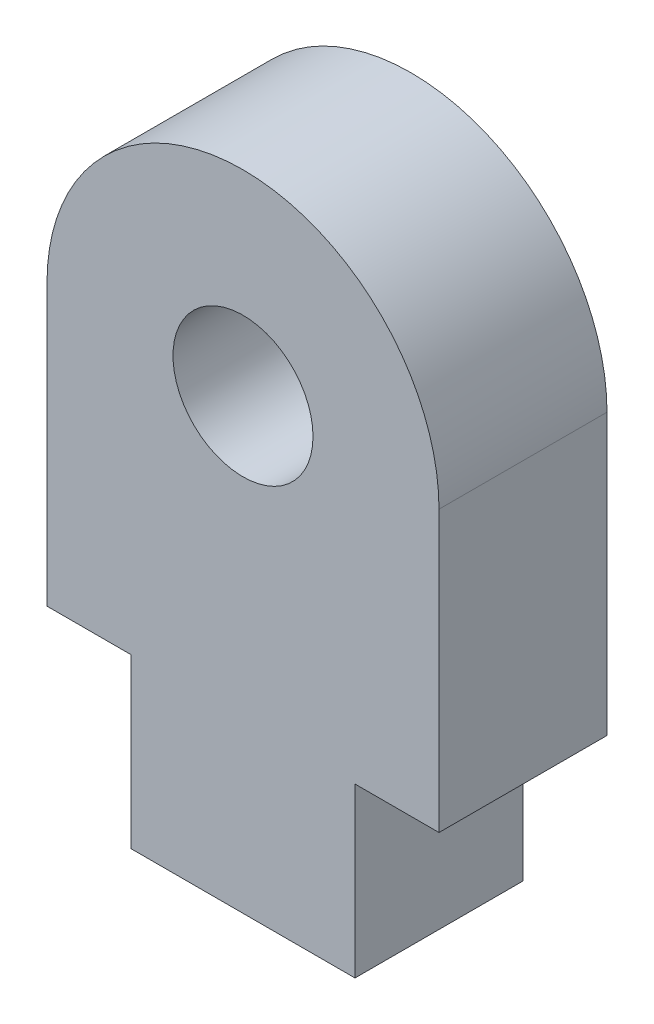
ISO-10303-21;
HEADER;
FILE_DESCRIPTION(('STEP AP214'),'2;1');
FILE_NAME('part.step','',(''),(''),'','','');
FILE_SCHEMA(('AUTOMOTIVE_DESIGN { 1 0 10303 214 1 1 1 1 }'));
ENDSEC;
DATA;
#1=APPLICATION_CONTEXT('core data for automotive mechanical design processes');
#2=APPLICATION_PROTOCOL_DEFINITION('international standard','automotive_design',2000,#1);
#3=PRODUCT_CONTEXT('',#1,'mechanical');
#4=PRODUCT('Part','Part','',(#3));
#5=PRODUCT_RELATED_PRODUCT_CATEGORY('part','',(#4));
#6=PRODUCT_DEFINITION_FORMATION('','',#4);
#7=PRODUCT_DEFINITION_CONTEXT('part definition',#1,'design');
#8=PRODUCT_DEFINITION('design','',#6,#7);
#9=PRODUCT_DEFINITION_SHAPE('','',#8);
#10=(LENGTH_UNIT() NAMED_UNIT(*) SI_UNIT(.MILLI.,.METRE.));
#11=(NAMED_UNIT(*) PLANE_ANGLE_UNIT() SI_UNIT($,.RADIAN.));
#12=(NAMED_UNIT(*) SI_UNIT($,.STERADIAN.) SOLID_ANGLE_UNIT());
#13=UNCERTAINTY_MEASURE_WITH_UNIT(LENGTH_MEASURE(1.E-05),#10,'distance_accuracy_value','');
#14=(GEOMETRIC_REPRESENTATION_CONTEXT(3) GLOBAL_UNCERTAINTY_ASSIGNED_CONTEXT((#13)) GLOBAL_UNIT_ASSIGNED_CONTEXT((#10,
#11,#12)) REPRESENTATION_CONTEXT('',''));
#15=CARTESIAN_POINT('',(0.,0.,0.));
#16=DIRECTION('',(0.,0.,1.));
#17=DIRECTION('',(1.,0.,0.));
#18=AXIS2_PLACEMENT_3D('',#15,#16,#17);
#19=CARTESIAN_POINT('',(0.,0.,3.));
#20=DIRECTION('',(0.,0.,1.));
#21=DIRECTION('',(1.,0.,0.));
#22=AXIS2_PLACEMENT_3D('',#19,#20,#21);
#23=PLANE('',#22);
#24=CARTESIAN_POINT('',(0.,0.,3.));
#25=DIRECTION('',(0.,0.,1.));
#26=DIRECTION('',(1.,0.,0.));
#27=AXIS2_PLACEMENT_3D('',#24,#25,#26);
#28=CIRCLE('',#27,3.5);
#29=CARTESIAN_POINT('',(3.5,0.,3.));
#30=VERTEX_POINT('',#29);
#31=CARTESIAN_POINT('',(-3.5,0.,3.));
#32=VERTEX_POINT('',#31);
#33=EDGE_CURVE('E145',#30,#32,#28,.T.);
#34=ORIENTED_EDGE('',*,*,#33,.T.);
#35=DIRECTION('',(0.,-1.,0.));
#36=VECTOR('',#35,1.);
#37=CARTESIAN_POINT('',(-3.5,0.,3.));
#38=LINE('',#37,#36);
#39=CARTESIAN_POINT('',(-3.5,-5.,3.));
#40=VERTEX_POINT('',#39);
#41=EDGE_CURVE('E93',#32,#40,#38,.T.);
#42=ORIENTED_EDGE('',*,*,#41,.T.);
#43=DIRECTION('',(1.,0.,0.));
#44=VECTOR('',#43,1.);
#45=CARTESIAN_POINT('',(-3.5,-5.,3.));
#46=LINE('',#45,#44);
#47=CARTESIAN_POINT('',(-2.,-5.,3.));
#48=VERTEX_POINT('',#47);
#49=EDGE_CURVE('E160',#40,#48,#46,.T.);
#50=ORIENTED_EDGE('',*,*,#49,.T.);
#51=DIRECTION('',(0.,-1.,0.));
#52=VECTOR('',#51,1.);
#53=CARTESIAN_POINT('',(-2.,-5.,3.));
#54=LINE('',#53,#52);
#55=CARTESIAN_POINT('',(-2.,-8.,3.));
#56=VERTEX_POINT('',#55);
#57=EDGE_CURVE('E173',#48,#56,#54,.T.);
#58=ORIENTED_EDGE('',*,*,#57,.T.);
#59=DIRECTION('',(1.,0.,0.));
#60=VECTOR('',#59,1.);
#61=CARTESIAN_POINT('',(-2.,-8.,3.));
#62=LINE('',#61,#60);
#63=CARTESIAN_POINT('',(2.,-8.,3.));
#64=VERTEX_POINT('',#63);
#65=EDGE_CURVE('E112',#56,#64,#62,.T.);
#66=ORIENTED_EDGE('',*,*,#65,.T.);
#67=DIRECTION('',(0.,1.,0.));
#68=VECTOR('',#67,1.);
#69=CARTESIAN_POINT('',(2.,-8.,3.));
#70=LINE('',#69,#68);
#71=CARTESIAN_POINT('',(2.,-5.,3.));
#72=VERTEX_POINT('',#71);
#73=EDGE_CURVE('E106',#64,#72,#70,.T.);
#74=ORIENTED_EDGE('',*,*,#73,.T.);
#75=DIRECTION('',(1.,0.,0.));
#76=VECTOR('',#75,1.);
#77=CARTESIAN_POINT('',(2.,-5.,3.));
#78=LINE('',#77,#76);
#79=CARTESIAN_POINT('',(3.5,-5.,3.));
#80=VERTEX_POINT('',#79);
#81=EDGE_CURVE('E110',#72,#80,#78,.T.);
#82=ORIENTED_EDGE('',*,*,#81,.T.);
#83=DIRECTION('',(0.,1.,0.));
#84=VECTOR('',#83,1.);
#85=CARTESIAN_POINT('',(3.5,-5.,3.));
#86=LINE('',#85,#84);
#87=EDGE_CURVE('E50',#80,#30,#86,.T.);
#88=ORIENTED_EDGE('',*,*,#87,.T.);
#89=EDGE_LOOP('',(#34,#42,#50,#58,#66,#74,#82,#88));
#90=FACE_BOUND('',#89,.T.);
#91=CARTESIAN_POINT('',(0.,0.,3.));
#92=DIRECTION('',(0.,0.,1.));
#93=DIRECTION('',(1.,0.,0.));
#94=AXIS2_PLACEMENT_3D('',#91,#92,#93);
#95=CIRCLE('',#94,1.25);
#96=CARTESIAN_POINT('',(1.25,0.,3.));
#97=VERTEX_POINT('',#96);
#98=EDGE_CURVE('E134',#97,#97,#95,.T.);
#99=ORIENTED_EDGE('',*,*,#98,.F.);
#100=EDGE_LOOP('',(#99));
#101=FACE_BOUND('',#100,.T.);
#102=ADVANCED_FACE('F33',(#90,#101),#23,.T.);
#103=CARTESIAN_POINT('',(0.,0.,0.));
#104=DIRECTION('',(0.,0.,1.));
#105=DIRECTION('',(1.,0.,0.));
#106=AXIS2_PLACEMENT_3D('',#103,#104,#105);
#107=PLANE('',#106);
#108=CARTESIAN_POINT('',(0.,0.,0.));
#109=DIRECTION('',(0.,0.,1.));
#110=DIRECTION('',(1.,0.,0.));
#111=AXIS2_PLACEMENT_3D('',#108,#109,#110);
#112=CIRCLE('',#111,3.5);
#113=CARTESIAN_POINT('',(3.5,0.,0.));
#114=VERTEX_POINT('',#113);
#115=CARTESIAN_POINT('',(-3.5,0.,0.));
#116=VERTEX_POINT('',#115);
#117=EDGE_CURVE('E130',#114,#116,#112,.T.);
#118=ORIENTED_EDGE('',*,*,#117,.F.);
#119=DIRECTION('',(0.,1.,0.));
#120=VECTOR('',#119,1.);
#121=CARTESIAN_POINT('',(3.5,-5.,0.));
#122=LINE('',#121,#120);
#123=CARTESIAN_POINT('',(3.5,-5.,0.));
#124=VERTEX_POINT('',#123);
#125=EDGE_CURVE('E85',#124,#114,#122,.T.);
#126=ORIENTED_EDGE('',*,*,#125,.F.);
#127=DIRECTION('',(1.,0.,0.));
#128=VECTOR('',#127,1.);
#129=CARTESIAN_POINT('',(2.,-5.,0.));
#130=LINE('',#129,#128);
#131=CARTESIAN_POINT('',(2.,-5.,0.));
#132=VERTEX_POINT('',#131);
#133=EDGE_CURVE('E79',#132,#124,#130,.T.);
#134=ORIENTED_EDGE('',*,*,#133,.F.);
#135=DIRECTION('',(0.,1.,0.));
#136=VECTOR('',#135,1.);
#137=CARTESIAN_POINT('',(2.,-8.,0.));
#138=LINE('',#137,#136);
#139=CARTESIAN_POINT('',(2.,-8.,0.));
#140=VERTEX_POINT('',#139);
#141=EDGE_CURVE('E120',#140,#132,#138,.T.);
#142=ORIENTED_EDGE('',*,*,#141,.F.);
#143=DIRECTION('',(1.,0.,0.));
#144=VECTOR('',#143,1.);
#145=CARTESIAN_POINT('',(-2.,-8.,0.));
#146=LINE('',#145,#144);
#147=CARTESIAN_POINT('',(-2.,-8.,0.));
#148=VERTEX_POINT('',#147);
#149=EDGE_CURVE('E140',#148,#140,#146,.T.);
#150=ORIENTED_EDGE('',*,*,#149,.F.);
#151=DIRECTION('',(0.,-1.,0.));
#152=VECTOR('',#151,1.);
#153=CARTESIAN_POINT('',(-2.,-5.,0.));
#154=LINE('',#153,#152);
#155=CARTESIAN_POINT('',(-2.,-5.,0.));
#156=VERTEX_POINT('',#155);
#157=EDGE_CURVE('E138',#156,#148,#154,.T.);
#158=ORIENTED_EDGE('',*,*,#157,.F.);
#159=DIRECTION('',(1.,0.,0.));
#160=VECTOR('',#159,1.);
#161=CARTESIAN_POINT('',(-3.5,-5.,0.));
#162=LINE('',#161,#160);
#163=CARTESIAN_POINT('',(-3.5,-5.,0.));
#164=VERTEX_POINT('',#163);
#165=EDGE_CURVE('E136',#164,#156,#162,.T.);
#166=ORIENTED_EDGE('',*,*,#165,.F.);
#167=DIRECTION('',(0.,-1.,0.));
#168=VECTOR('',#167,1.);
#169=CARTESIAN_POINT('',(-3.5,0.,0.));
#170=LINE('',#169,#168);
#171=EDGE_CURVE('E133',#116,#164,#170,.T.);
#172=ORIENTED_EDGE('',*,*,#171,.F.);
#173=EDGE_LOOP('',(#118,#126,#134,#142,#150,#158,#166,#172));
#174=FACE_BOUND('',#173,.T.);
#175=CARTESIAN_POINT('',(0.,0.,0.));
#176=DIRECTION('',(0.,0.,1.));
#177=DIRECTION('',(1.,0.,0.));
#178=AXIS2_PLACEMENT_3D('',#175,#176,#177);
#179=CIRCLE('',#178,1.25);
#180=CARTESIAN_POINT('',(1.25,0.,0.));
#181=VERTEX_POINT('',#180);
#182=EDGE_CURVE('E179',#181,#181,#179,.T.);
#183=ORIENTED_EDGE('',*,*,#182,.T.);
#184=EDGE_LOOP('',(#183));
#185=FACE_BOUND('',#184,.T.);
#186=ADVANCED_FACE('F164',(#174,#185),#107,.F.);
#187=CARTESIAN_POINT('',(0.,0.,3.));
#188=DIRECTION('',(0.,0.,-1.));
#189=DIRECTION('',(-1.,0.,0.));
#190=AXIS2_PLACEMENT_3D('',#187,#188,#189);
#191=CYLINDRICAL_SURFACE('',#190,3.5);
#192=ORIENTED_EDGE('',*,*,#117,.T.);
#193=DIRECTION('',(0.,0.,-1.));
#194=VECTOR('',#193,1.);
#195=CARTESIAN_POINT('',(-3.5,0.,3.));
#196=LINE('',#195,#194);
#197=EDGE_CURVE('E11',#32,#116,#196,.T.);
#198=ORIENTED_EDGE('',*,*,#197,.F.);
#199=ORIENTED_EDGE('',*,*,#33,.F.);
#200=DIRECTION('',(0.,0.,-1.));
#201=VECTOR('',#200,1.);
#202=CARTESIAN_POINT('',(3.5,0.,3.));
#203=LINE('',#202,#201);
#204=EDGE_CURVE('E126',#30,#114,#203,.T.);
#205=ORIENTED_EDGE('',*,*,#204,.T.);
#206=EDGE_LOOP('',(#192,#198,#199,#205));
#207=FACE_BOUND('',#206,.T.);
#208=ADVANCED_FACE('F35',(#207),#191,.T.);
#209=CARTESIAN_POINT('',(-3.5,0.,3.));
#210=DIRECTION('',(1.,0.,0.));
#211=DIRECTION('',(0.,1.,0.));
#212=AXIS2_PLACEMENT_3D('',#209,#210,#211);
#213=PLANE('',#212);
#214=ORIENTED_EDGE('',*,*,#171,.T.);
#215=DIRECTION('',(0.,0.,-1.));
#216=VECTOR('',#215,1.);
#217=CARTESIAN_POINT('',(-3.5,-5.,3.));
#218=LINE('',#217,#216);
#219=EDGE_CURVE('E42',#40,#164,#218,.T.);
#220=ORIENTED_EDGE('',*,*,#219,.F.);
#221=ORIENTED_EDGE('',*,*,#41,.F.);
#222=ORIENTED_EDGE('',*,*,#197,.T.);
#223=EDGE_LOOP('',(#214,#220,#221,#222));
#224=FACE_BOUND('',#223,.T.);
#225=ADVANCED_FACE('F207',(#224),#213,.F.);
#226=CARTESIAN_POINT('',(-3.5,-5.,3.));
#227=DIRECTION('',(0.,1.,0.));
#228=DIRECTION('',(0.,0.,1.));
#229=AXIS2_PLACEMENT_3D('',#226,#227,#228);
#230=PLANE('',#229);
#231=ORIENTED_EDGE('',*,*,#165,.T.);
#232=DIRECTION('',(0.,0.,-1.));
#233=VECTOR('',#232,1.);
#234=CARTESIAN_POINT('',(-2.,-5.,3.));
#235=LINE('',#234,#233);
#236=EDGE_CURVE('E152',#48,#156,#235,.T.);
#237=ORIENTED_EDGE('',*,*,#236,.F.);
#238=ORIENTED_EDGE('',*,*,#49,.F.);
#239=ORIENTED_EDGE('',*,*,#219,.T.);
#240=EDGE_LOOP('',(#231,#237,#238,#239));
#241=FACE_BOUND('',#240,.T.);
#242=ADVANCED_FACE('F158',(#241),#230,.F.);
#243=CARTESIAN_POINT('',(-2.,-5.,3.));
#244=DIRECTION('',(1.,0.,0.));
#245=DIRECTION('',(0.,1.,0.));
#246=AXIS2_PLACEMENT_3D('',#243,#244,#245);
#247=PLANE('',#246);
#248=ORIENTED_EDGE('',*,*,#157,.T.);
#249=DIRECTION('',(0.,0.,-1.));
#250=VECTOR('',#249,1.);
#251=CARTESIAN_POINT('',(-2.,-8.,3.));
#252=LINE('',#251,#250);
#253=EDGE_CURVE('E149',#56,#148,#252,.T.);
#254=ORIENTED_EDGE('',*,*,#253,.F.);
#255=ORIENTED_EDGE('',*,*,#57,.F.);
#256=ORIENTED_EDGE('',*,*,#236,.T.);
#257=EDGE_LOOP('',(#248,#254,#255,#256));
#258=FACE_BOUND('',#257,.T.);
#259=ADVANCED_FACE('F169',(#258),#247,.F.);
#260=CARTESIAN_POINT('',(-2.,-8.,3.));
#261=DIRECTION('',(0.,1.,0.));
#262=DIRECTION('',(0.,0.,1.));
#263=AXIS2_PLACEMENT_3D('',#260,#261,#262);
#264=PLANE('',#263);
#265=ORIENTED_EDGE('',*,*,#149,.T.);
#266=DIRECTION('',(0.,0.,-1.));
#267=VECTOR('',#266,1.);
#268=CARTESIAN_POINT('',(2.,-8.,3.));
#269=LINE('',#268,#267);
#270=EDGE_CURVE('E121',#64,#140,#269,.T.);
#271=ORIENTED_EDGE('',*,*,#270,.F.);
#272=ORIENTED_EDGE('',*,*,#65,.F.);
#273=ORIENTED_EDGE('',*,*,#253,.T.);
#274=EDGE_LOOP('',(#265,#271,#272,#273));
#275=FACE_BOUND('',#274,.T.);
#276=ADVANCED_FACE('F172',(#275),#264,.F.);
#277=CARTESIAN_POINT('',(2.,-8.,3.));
#278=DIRECTION('',(-1.,0.,0.));
#279=DIRECTION('',(0.,0.,1.));
#280=AXIS2_PLACEMENT_3D('',#277,#278,#279);
#281=PLANE('',#280);
#282=ORIENTED_EDGE('',*,*,#141,.T.);
#283=DIRECTION('',(0.,0.,-1.));
#284=VECTOR('',#283,1.);
#285=CARTESIAN_POINT('',(2.,-5.,3.));
#286=LINE('',#285,#284);
#287=EDGE_CURVE('E117',#72,#132,#286,.T.);
#288=ORIENTED_EDGE('',*,*,#287,.F.);
#289=ORIENTED_EDGE('',*,*,#73,.F.);
#290=ORIENTED_EDGE('',*,*,#270,.T.);
#291=EDGE_LOOP('',(#282,#288,#289,#290));
#292=FACE_BOUND('',#291,.T.);
#293=ADVANCED_FACE('F118',(#292),#281,.F.);
#294=CARTESIAN_POINT('',(2.,-5.,3.));
#295=DIRECTION('',(0.,1.,0.));
#296=DIRECTION('',(0.,0.,1.));
#297=AXIS2_PLACEMENT_3D('',#294,#295,#296);
#298=PLANE('',#297);
#299=ORIENTED_EDGE('',*,*,#133,.T.);
#300=DIRECTION('',(0.,0.,-1.));
#301=VECTOR('',#300,1.);
#302=CARTESIAN_POINT('',(3.5,-5.,3.));
#303=LINE('',#302,#301);
#304=EDGE_CURVE('E122',#80,#124,#303,.T.);
#305=ORIENTED_EDGE('',*,*,#304,.F.);
#306=ORIENTED_EDGE('',*,*,#81,.F.);
#307=ORIENTED_EDGE('',*,*,#287,.T.);
#308=EDGE_LOOP('',(#299,#305,#306,#307));
#309=FACE_BOUND('',#308,.T.);
#310=ADVANCED_FACE('F124',(#309),#298,.F.);
#311=CARTESIAN_POINT('',(3.5,-5.,3.));
#312=DIRECTION('',(-1.,0.,0.));
#313=DIRECTION('',(0.,0.,1.));
#314=AXIS2_PLACEMENT_3D('',#311,#312,#313);
#315=PLANE('',#314);
#316=ORIENTED_EDGE('',*,*,#125,.T.);
#317=ORIENTED_EDGE('',*,*,#204,.F.);
#318=ORIENTED_EDGE('',*,*,#87,.F.);
#319=ORIENTED_EDGE('',*,*,#304,.T.);
#320=EDGE_LOOP('',(#316,#317,#318,#319));
#321=FACE_BOUND('',#320,.T.);
#322=ADVANCED_FACE('F195',(#321),#315,.F.);
#323=CARTESIAN_POINT('',(0.,0.,3.));
#324=DIRECTION('',(0.,0.,-1.));
#325=DIRECTION('',(-1.,0.,0.));
#326=AXIS2_PLACEMENT_3D('',#323,#324,#325);
#327=CYLINDRICAL_SURFACE('',#326,1.25);
#328=ORIENTED_EDGE('',*,*,#98,.T.);
#329=EDGE_LOOP('',(#328));
#330=FACE_BOUND('',#329,.T.);
#331=ORIENTED_EDGE('',*,*,#182,.F.);
#332=EDGE_LOOP('',(#331));
#333=FACE_BOUND('',#332,.T.);
#334=ADVANCED_FACE('F185',(#330,#333),#327,.F.);
#335=CLOSED_SHELL('',(#102,#186,#208,#225,#242,#259,#276,#293,#310,#322,#334));
#336=MANIFOLD_SOLID_BREP('B2',#335);
#337=ADVANCED_BREP_SHAPE_REPRESENTATION('',(#18,#336),#14);
#338=SHAPE_DEFINITION_REPRESENTATION(#9,#337);
ENDSEC;
END-ISO-10303-21;
